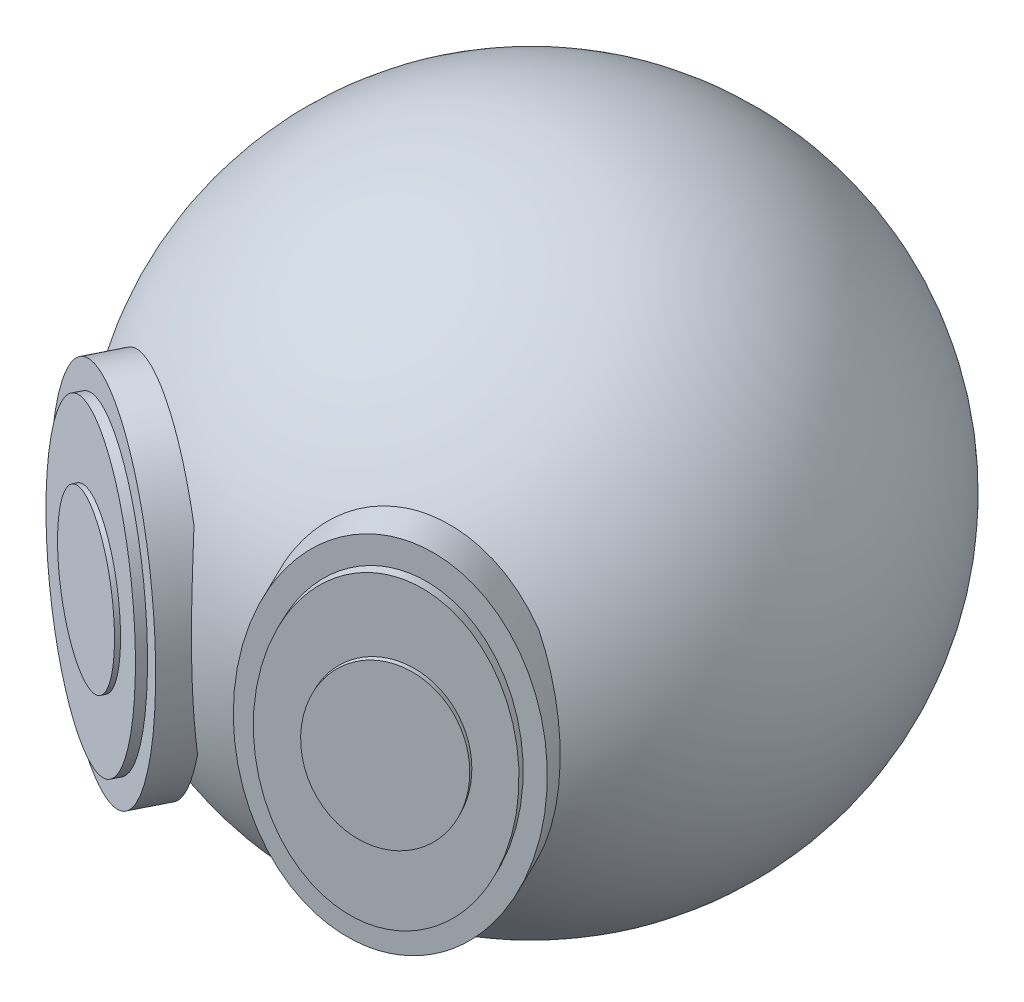
ISO-10303-21;
HEADER;
FILE_DESCRIPTION(('STEP AP214'),'2;1');
FILE_NAME('part.step','',(''),(''),'','','');
FILE_SCHEMA(('AUTOMOTIVE_DESIGN { 1 0 10303 214 1 1 1 1 }'));
ENDSEC;
DATA;
#1=APPLICATION_CONTEXT('core data for automotive mechanical design processes');
#2=APPLICATION_PROTOCOL_DEFINITION('international standard','automotive_design',2000,#1);
#3=PRODUCT_CONTEXT('',#1,'mechanical');
#4=PRODUCT('Part','Part','',(#3));
#5=PRODUCT_RELATED_PRODUCT_CATEGORY('part','',(#4));
#6=PRODUCT_DEFINITION_FORMATION('','',#4);
#7=PRODUCT_DEFINITION_CONTEXT('part definition',#1,'design');
#8=PRODUCT_DEFINITION('design','',#6,#7);
#9=PRODUCT_DEFINITION_SHAPE('','',#8);
#10=(LENGTH_UNIT() NAMED_UNIT(*) SI_UNIT(.MILLI.,.METRE.));
#11=(NAMED_UNIT(*) PLANE_ANGLE_UNIT() SI_UNIT($,.RADIAN.));
#12=(NAMED_UNIT(*) SI_UNIT($,.STERADIAN.) SOLID_ANGLE_UNIT());
#13=UNCERTAINTY_MEASURE_WITH_UNIT(LENGTH_MEASURE(1.E-05),#10,'distance_accuracy_value','');
#14=(GEOMETRIC_REPRESENTATION_CONTEXT(3) GLOBAL_UNCERTAINTY_ASSIGNED_CONTEXT((#13)) GLOBAL_UNIT_ASSIGNED_CONTEXT((#10,
#11,#12)) REPRESENTATION_CONTEXT('',''));
#15=CARTESIAN_POINT('',(0.,0.,0.));
#16=DIRECTION('',(0.,0.,1.));
#17=DIRECTION('',(1.,0.,0.));
#18=AXIS2_PLACEMENT_3D('',#15,#16,#17);
#19=CARTESIAN_POINT('',(-20.6427091276719,92.9829289428076,0.));
#20=DIRECTION('',(0.,1.,0.));
#21=DIRECTION('',(1.,0.,0.));
#22=AXIS2_PLACEMENT_3D('',#19,#20,#21);
#23=SPHERICAL_SURFACE('',#22,35.);
#24=CARTESIAN_POINT('',(-24.2981723340069,82.7245554784162,33.2626421471927));
#25=CARTESIAN_POINT('',(-24.2222567717519,83.0491589725357,33.371097447052));
#26=CARTESIAN_POINT('',(-24.151132069831,83.3765992512746,33.4743533871921));
#27=CARTESIAN_POINT('',(-24.0181068443481,84.0364422922967,33.6703114712531));
#28=CARTESIAN_POINT('',(-23.9562054797331,84.3688445990601,33.7630145772785));
#29=CARTESIAN_POINT('',(-23.8412765864362,85.037838316832,33.9376999629664));
#30=CARTESIAN_POINT('',(-23.7882458359065,85.3744281589779,34.0196861326948));
#31=CARTESIAN_POINT('',(-23.6907506248793,86.0512708374841,34.17286014985));
#32=CARTESIAN_POINT('',(-23.6462863837895,86.3915237674288,34.2440477206902));
#33=CARTESIAN_POINT('',(-23.5254121712472,87.4166133211377,34.4412041212363));
#34=CARTESIAN_POINT('',(-23.4614548644011,88.1061687773652,34.5508678538252));
#35=CARTESIAN_POINT('',(-23.3654876707696,89.4930063099794,34.7260411970147));
#36=CARTESIAN_POINT('',(-23.3334801251313,90.1902889487975,34.7915475718315));
#37=CARTESIAN_POINT('',(-23.3007703040282,91.588208229287,34.8780728142347));
#38=CARTESIAN_POINT('',(-23.3000612714456,92.2888441143501,34.8991012833389));
#39=CARTESIAN_POINT('',(-23.3298867754291,93.6894376761998,34.896570838715));
#40=CARTESIAN_POINT('',(-23.3604248498581,94.3893952672061,34.8730068758816));
#41=CARTESIAN_POINT('',(-23.4582688352174,95.8592689052093,34.7764446235933));
#42=CARTESIAN_POINT('',(-23.5291726113636,96.6286213224639,34.6984070575232));
#43=CARTESIAN_POINT('',(-23.7115722291384,98.1550587159102,34.4881530378568));
#44=CARTESIAN_POINT('',(-23.8230618671184,98.9121455484636,34.3559448639832));
#45=CARTESIAN_POINT('',(-24.0251069430692,100.046558205304,34.1148941039518));
#46=CARTESIAN_POINT('',(-24.0998372934133,100.430984157332,34.0255208570545));
#47=CARTESIAN_POINT('',(-24.2614492605759,101.19370873654,33.8326619511455));
#48=CARTESIAN_POINT('',(-24.3483302283448,101.572007689802,33.7291770459438));
#49=CARTESIAN_POINT('',(-24.534948697881,102.321703428092,33.5081979164037));
#50=CARTESIAN_POINT('',(-24.6346985359166,102.693093193859,33.3906902578836));
#51=CARTESIAN_POINT('',(-24.8478075181336,103.42738130467,33.142002315121));
#52=CARTESIAN_POINT('',(-24.9611696609854,103.790277757597,33.0108190190987));
#53=CARTESIAN_POINT('',(-25.0817252938831,104.148238487502,32.8729523810575));
#54=B_SPLINE_CURVE_WITH_KNOTS('',3,(#24,#25,#26,#27,#28,#29,#30,#31,#32,#33,#34,#35,#36,#37,#38,
#39,#40,#41,#42,#43,#44,#45,#46,#47,#48,#49,#50,#51,#52,#53),.UNSPECIFIED.,.F.,.F.,(4,2,2,2,2,2,
2,2,2,2,2,2,2,2,4),(0.,1.05157137944992,2.10304680997206,3.15413950661275,4.20525912053597,
6.30628263543237,8.40746009339388,10.508183920449,12.609145622183,14.9358374768093,
17.262173840102,18.4668491334846,19.6714601012739,20.8772345267191,22.0832750625911),.UNSPECIFIED.);
#55=CARTESIAN_POINT('',(-24.2981723340206,82.7245554783918,33.2626421471859));
#56=VERTEX_POINT('',#55);
#57=CARTESIAN_POINT('',(-25.0817252938998,104.148238487526,32.8729523810492));
#58=VERTEX_POINT('',#57);
#59=EDGE_CURVE('E237',#56,#58,#54,.T.);
#60=ORIENTED_EDGE('',*,*,#59,.F.);
#61=CARTESIAN_POINT('',(-34.6299454548464,92.9829289428076,28.1242705789723));
#62=DIRECTION('',(-0.445304960382193,0.,0.895378965722902));
#63=DIRECTION('',(0.895378965722902,0.,0.445304960382193));
#64=AXIS2_PLACEMENT_3D('',#61,#62,#63);
#65=CIRCLE('',#64,15.4396445661331);
#66=CARTESIAN_POINT('',(-44.504747512848,82.1777461212146,23.2131675627537));
#67=VERTEX_POINT('',#66);
#68=EDGE_CURVE('E230',#56,#67,#65,.F.);
#69=ORIENTED_EDGE('',*,*,#68,.T.);
#70=CARTESIAN_POINT('',(-43.6827854089606,104.651601063018,23.6219596118406));
#71=CARTESIAN_POINT('',(-43.8363377399057,104.37002522427,23.6112848937222));
#72=CARTESIAN_POINT('',(-43.983673047574,104.085043934045,23.6018104712494));
#73=CARTESIAN_POINT('',(-44.2660255710203,103.509038743438,23.5848005785608));
#74=CARTESIAN_POINT('',(-44.4010447439363,103.218015812178,23.5772647999305));
#75=CARTESIAN_POINT('',(-44.6588345130591,102.63082245896,23.563672473729));
#76=CARTESIAN_POINT('',(-44.7816140824973,102.33465599774,23.5576148376978));
#77=CARTESIAN_POINT('',(-45.0151578372269,101.737607744341,23.5465955114659));
#78=CARTESIAN_POINT('',(-45.1259213967096,101.4367257075,23.5416338783325));
#79=CARTESIAN_POINT('',(-45.4402090176429,100.528300131082,23.527892623255));
#80=CARTESIAN_POINT('',(-45.6259431624905,99.9144887863948,23.5202465390776));
#81=CARTESIAN_POINT('',(-45.9505761398571,98.6745738454274,23.5059148766946));
#82=CARTESIAN_POINT('',(-46.0894647053884,98.0484675862897,23.49922950923));
#83=CARTESIAN_POINT('',(-46.3208382694589,96.7881751994242,23.4853992316813));
#84=CARTESIAN_POINT('',(-46.4133537597444,96.153994662863,23.4782546270565));
#85=CARTESIAN_POINT('',(-46.5525044626234,94.880423777092,23.4625785441839));
#86=CARTESIAN_POINT('',(-46.5991229536354,94.2410316146168,23.4540465617932));
#87=CARTESIAN_POINT('',(-46.646649810065,92.9606579961621,23.435123609138));
#88=CARTESIAN_POINT('',(-46.6475634557949,92.3196767323294,23.424732853758));
#89=CARTESIAN_POINT('',(-46.6037990343197,91.0395241149965,23.4020327717149));
#90=CARTESIAN_POINT('',(-46.5591367343794,90.4003522122236,23.3897241098106));
#91=CARTESIAN_POINT('',(-46.4233645723454,89.1187843557572,23.3633662213213));
#92=CARTESIAN_POINT('',(-46.331671873617,88.4764505935048,23.3492968699076));
#93=CARTESIAN_POINT('',(-46.101350384298,87.2002531587313,23.3203497116773));
#94=CARTESIAN_POINT('',(-45.9627268453763,86.5663885467389,23.305471995475));
#95=CARTESIAN_POINT('',(-45.7174929228132,85.6175210735492,23.2833888106186));
#96=CARTESIAN_POINT('',(-45.6282960791918,85.2979332331253,23.2759838888655));
#97=CARTESIAN_POINT('',(-45.4374641403972,84.6624746578656,23.2615614309854));
#98=CARTESIAN_POINT('',(-45.3358294377307,84.3466038060759,23.2545438826441));
#99=CARTESIAN_POINT('',(-45.1199999155035,83.7190058517677,23.2411740478063));
#100=CARTESIAN_POINT('',(-45.005799394846,83.4072807026374,23.2348220658493));
#101=CARTESIAN_POINT('',(-44.764768619359,82.788700401116,23.2231398451208));
#102=CARTESIAN_POINT('',(-44.6379371480251,82.4818457211127,23.2178097049091));
#103=CARTESIAN_POINT('',(-44.504747512865,82.1777461212446,23.2131675627469));
#104=B_SPLINE_CURVE_WITH_KNOTS('',3,(#70,#71,#72,#73,#74,#75,#76,#77,#78,#79,#80,#81,#82,#83,
#84,#85,#86,#87,#88,#89,#90,#91,#92,#93,#94,#95,#96,#97,#98,#99,#100,#101,#102,#103),
.UNSPECIFIED.,.F.,.F.,(4,2,2,2,2,2,2,2,2,2,2,2,2,2,2,2,4),(0.,0.962581439278404,
1.92500964877472,2.88672700162827,3.84849441789137,5.770435011974,7.69279655800549,
9.61389242766158,11.5356879484321,13.4572614423312,15.3781703819498,17.3234814857843,
19.2685749767436,20.2640186114975,21.2594308407145,22.2552965641054,23.2512582936363),.UNSPECIFIED.);
#105=CARTESIAN_POINT('',(-43.682785408944,104.65160106304,23.6219596118489));
#106=VERTEX_POINT('',#105);
#107=EDGE_CURVE('E231',#106,#67,#104,.T.);
#108=ORIENTED_EDGE('',*,*,#107,.F.);
#109=EDGE_CURVE('E323',#106,#58,#65,.F.);
#110=ORIENTED_EDGE('',*,*,#109,.T.);
#111=EDGE_LOOP('',(#60,#69,#108,#110));
#112=FACE_BOUND('',#111,.T.);
#113=CARTESIAN_POINT('',(3.81536109772755,83.0057575793629,22.962117768923));
#114=CARTESIAN_POINT('',(3.94594276543495,83.3315167364795,22.9645774272464));
#115=CARTESIAN_POINT('',(4.06945745790066,83.6600822059153,22.9677289091505));
#116=CARTESIAN_POINT('',(4.30245567524122,84.3221082613997,22.9750305378118));
#117=CARTESIAN_POINT('',(4.41194051110605,84.6555683868275,22.9791805911552));
#118=CARTESIAN_POINT('',(4.61696428199144,85.3265903086422,22.9880931630469));
#119=CARTESIAN_POINT('',(4.71250889706374,85.6641503734027,22.9928554306476));
#120=CARTESIAN_POINT('',(4.88979105274628,86.3428580034786,23.0026949657917));
#121=CARTESIAN_POINT('',(4.97152823222505,86.6840056623792,23.0077722415695));
#122=CARTESIAN_POINT('',(5.19607577106631,87.7116536137169,23.0230822292017));
#123=CARTESIAN_POINT('',(5.31834262323215,88.4027552509977,23.0333989821566));
#124=CARTESIAN_POINT('',(5.50838528992758,89.7923937279887,23.0528278632463));
#125=CARTESIAN_POINT('',(5.57615504143288,90.4909313862293,23.0619398572525));
#126=CARTESIAN_POINT('',(5.65737247955005,91.8910612278794,23.0782405097496));
#127=CARTESIAN_POINT('',(5.67083042810459,92.5926528091843,23.0854295313369));
#128=CARTESIAN_POINT('',(5.64341930005406,93.9948041573588,23.0977767519847));
#129=CARTESIAN_POINT('',(5.60254980605974,94.6953639162598,23.1029349354422));
#130=CARTESIAN_POINT('',(5.4669952588152,96.0837644320592,23.1116763568978));
#131=CARTESIAN_POINT('',(5.37288487320051,96.7716613098604,23.1152756998436));
#132=CARTESIAN_POINT('',(5.13085109781815,98.1379342560205,23.1220799868563));
#133=CARTESIAN_POINT('',(4.98293661227175,98.8163118804707,23.1252849960655));
#134=CARTESIAN_POINT('',(4.71789366049756,99.8322348826407,23.131232513563));
#135=CARTESIAN_POINT('',(4.62077012936619,100.175109683099,23.1334420795384));
#136=CARTESIAN_POINT('',(4.41204111825134,100.856430899974,23.1385903434716));
#137=CARTESIAN_POINT('',(4.30043611425111,101.194877461537,23.1415290174675));
#138=CARTESIAN_POINT('',(4.06253520341563,101.866816023731,23.1485327453388));
#139=CARTESIAN_POINT('',(3.93622947598942,102.200304542543,23.1525985547142));
#140=CARTESIAN_POINT('',(3.66880809919841,102.861312754019,23.1623590860849));
#141=CARTESIAN_POINT('',(3.52769049110377,103.188831650518,23.168054023689));
#142=CARTESIAN_POINT('',(3.3790939967478,103.512930597514,23.1748147738767));
#143=B_SPLINE_CURVE_WITH_KNOTS('',3,(#113,#114,#115,#116,#117,#118,#119,#120,#121,#122,#123,
#124,#125,#126,#127,#128,#129,#130,#131,#132,#133,#134,#135,#136,#137,#138,#139,#140,#141,#142),
.UNSPECIFIED.,.F.,.F.,(4,2,2,2,2,2,2,2,2,2,2,2,2,2,4),(0.,1.05278279818046,2.10546714947467,
3.15772137123988,4.21000311030143,6.31332723491344,8.41688533053484,10.5200459507952,
12.6232227294038,14.7041200416546,16.7846731357788,17.8535227903216,18.9223373223502,
19.9918700024306,21.0615442966208),.UNSPECIFIED.);
#144=CARTESIAN_POINT('',(3.81536109772913,83.0057575793659,22.9621177689223));
#145=VERTEX_POINT('',#144);
#146=CARTESIAN_POINT('',(3.37909399674342,103.512930597525,23.1748147738761));
#147=VERTEX_POINT('',#146);
#148=EDGE_CURVE('E223',#145,#147,#143,.T.);
#149=ORIENTED_EDGE('',*,*,#148,.F.);
#150=CARTESIAN_POINT('',(-6.90066101043163,92.9829289428076,28.1865910383382));
#151=DIRECTION('',(0.438230202974221,0.,0.898862775512021));
#152=DIRECTION('',(0.898862775512021,0.,-0.438230202974221));
#153=AXIS2_PLACEMENT_3D('',#150,#151,#152);
#154=CIRCLE('',#153,15.5458096984663);
#155=CARTESIAN_POINT('',(-16.011978069711,81.196339521691,32.6287088265356));
#156=VERTEX_POINT('',#155);
#157=EDGE_CURVE('E11',#145,#156,#154,.F.);
#158=ORIENTED_EDGE('',*,*,#157,.T.);
#159=CARTESIAN_POINT('',(-15.5005641438892,105.235864475538,32.3793748518484));
#160=CARTESIAN_POINT('',(-15.6031718765869,104.960971748396,32.4996967662195));
#161=CARTESIAN_POINT('',(-15.7011061181221,104.682579193998,32.6159370370103));
#162=CARTESIAN_POINT('',(-15.888063959703,104.119557583829,32.8400568649018));
#163=CARTESIAN_POINT('',(-15.9770889207752,103.834929488755,32.9479376984619));
#164=CARTESIAN_POINT('',(-16.1466312685285,103.260333635811,33.155099469621));
#165=CARTESIAN_POINT('',(-16.2271550641115,102.970370096741,33.2543868753539));
#166=CARTESIAN_POINT('',(-16.3801432194972,102.385533730335,33.4443114039332));
#167=CARTESIAN_POINT('',(-16.4526072360005,102.090660694499,33.534948158289));
#168=CARTESIAN_POINT('',(-16.6583183155314,101.199961264181,33.7935755930772));
#169=CARTESIAN_POINT('',(-16.7800259420637,100.597568923007,33.9484582367201));
#170=CARTESIAN_POINT('',(-16.9946890441763,99.3796465698547,34.2224387391346));
#171=CARTESIAN_POINT('',(-17.0876380879947,98.7641136518875,34.3415285927973));
#172=CARTESIAN_POINT('',(-17.2462140339745,97.5239408636872,34.5433607891046));
#173=CARTESIAN_POINT('',(-17.3118534090417,96.8993052860501,34.6261197258051));
#174=CARTESIAN_POINT('',(-17.4168583201862,95.6441480491727,34.7550364884726));
#175=CARTESIAN_POINT('',(-17.4562258760924,95.0136268462112,34.8011971282397));
#176=CARTESIAN_POINT('',(-17.5092669503844,93.7499645298865,34.8567617127635));
#177=CARTESIAN_POINT('',(-17.5229432193557,93.1168237042629,34.8661695924965));
#178=CARTESIAN_POINT('',(-17.5247979557996,91.8509970633836,34.8482141927361));
#179=CARTESIAN_POINT('',(-17.512975308292,91.2183112692349,34.8208493053154));
#180=CARTESIAN_POINT('',(-17.4636426193839,89.9565381236854,34.7294582141782));
#181=CARTESIAN_POINT('',(-17.4261301080993,89.3274511241457,34.6654284855142));
#182=CARTESIAN_POINT('',(-17.3248435469091,88.0762062510829,34.5009633258345));
#183=CARTESIAN_POINT('',(-17.2610720914955,87.4540476992361,34.4005314916143));
#184=CARTESIAN_POINT('',(-17.1228879487031,86.3525781036131,34.1891279130861));
#185=CARTESIAN_POINT('',(-17.0536986044912,85.8712736903828,34.0850472699365));
#186=CARTESIAN_POINT('',(-16.8978122976389,84.9168828384826,33.8550085474954));
#187=CARTESIAN_POINT('',(-16.8111189157922,84.4437947404665,33.7290549434826));
#188=CARTESIAN_POINT('',(-16.6178697492119,83.5007136584511,33.4535881217482));
#189=CARTESIAN_POINT('',(-16.5110395078872,83.0308695961218,33.3037544041703));
#190=CARTESIAN_POINT('',(-16.3356128178734,82.3355098703499,33.0627443722292));
#191=CARTESIAN_POINT('',(-16.2745876568469,82.1052273314001,32.9796720318226));
#192=CARTESIAN_POINT('',(-16.1472774836452,81.6481170404903,32.8081814791874));
#193=CARTESIAN_POINT('',(-16.0809921519293,81.4212894994109,32.7197629422701));
#194=CARTESIAN_POINT('',(-16.0119780697095,81.196339521689,32.6287088265349));
#195=B_SPLINE_CURVE_WITH_KNOTS('',3,(#159,#160,#161,#162,#163,#164,#165,#166,#167,#168,#169,
#170,#171,#172,#173,#174,#175,#176,#177,#178,#179,#180,#181,#182,#183,#184,#185,#186,#187,#188,
#189,#190,#191,#192,#193,#194),.UNSPECIFIED.,.F.,.F.,(4,2,2,2,2,2,2,2,2,2,2,2,2,2,2,2,2,4),(0.,
0.951270888196315,1.90239623292455,2.85279933968637,3.80324291258064,5.7025290715909,
7.60223969312985,9.50108172150492,11.3997777463625,13.2982704795908,15.1968462290768,
17.0956045377451,18.9941752862599,20.4851700351003,21.9758600802334,23.4885677304756,
24.2453490363208,25.0021763497644),.UNSPECIFIED.);
#196=CARTESIAN_POINT('',(-15.5005641438909,105.235864475536,32.3793748518493));
#197=VERTEX_POINT('',#196);
#198=EDGE_CURVE('E43',#197,#156,#195,.T.);
#199=ORIENTED_EDGE('',*,*,#198,.F.);
#200=EDGE_CURVE('E54',#197,#147,#154,.F.);
#201=ORIENTED_EDGE('',*,*,#200,.T.);
#202=EDGE_LOOP('',(#149,#158,#199,#201));
#203=FACE_BOUND('',#202,.T.);
#204=ADVANCED_FACE('F38',(#112,#203),#23,.T.);
#205=CARTESIAN_POINT('',(-19.8618332990336,0.,39.9363791981702));
#206=DIRECTION('',(-0.445304960382193,0.,0.895378965722902));
#207=DIRECTION('',(0.895378965722902,0.,0.445304960382193));
#208=AXIS2_PLACEMENT_3D('',#205,#206,#207);
#209=PLANE('',#208);
#210=CARTESIAN_POINT('',(-36.2736695818161,92.3779463059205,31.7741681283546));
#211=DIRECTION('',(-0.445304960382193,0.,0.895378965722902));
#212=DIRECTION('',(0.,1.,0.));
#213=AXIS2_PLACEMENT_3D('',#210,#211,#212);
#214=ELLIPSE('',#213,17.,11.);
#215=CARTESIAN_POINT('',(-36.2736695818161,109.37794630592,31.7741681283546));
#216=VERTEX_POINT('',#215);
#217=EDGE_CURVE('E693',#216,#216,#214,.T.);
#218=ORIENTED_EDGE('',*,*,#217,.F.);
#219=EDGE_LOOP('',(#218));
#220=FACE_BOUND('',#219,.T.);
#221=CARTESIAN_POINT('',(-36.2736695818161,92.3779463059205,31.7741681283546));
#222=DIRECTION('',(-0.445304960382193,0.,0.895378965722902));
#223=DIRECTION('',(0.,1.,0.));
#224=AXIS2_PLACEMENT_3D('',#221,#222,#223);
#225=ELLIPSE('',#224,20.,13.);
#226=CARTESIAN_POINT('',(-36.2736695818161,112.37794630592,31.7741681283546));
#227=VERTEX_POINT('',#226);
#228=EDGE_CURVE('E261',#227,#227,#225,.T.);
#229=ORIENTED_EDGE('',*,*,#228,.T.);
#230=EDGE_LOOP('',(#229));
#231=FACE_BOUND('',#230,.T.);
#232=ADVANCED_FACE('F337',(#220,#231),#209,.T.);
#233=CARTESIAN_POINT('',(-18.0806134575048,0.,36.3548633352786));
#234=DIRECTION('',(-0.445304960382193,0.,0.895378965722902));
#235=DIRECTION('',(0.895378965722902,0.,0.445304960382193));
#236=AXIS2_PLACEMENT_3D('',#233,#234,#235);
#237=PLANE('',#236);
#238=ORIENTED_EDGE('',*,*,#109,.F.);
#239=CARTESIAN_POINT('',(-34.4924497402873,92.3779463059205,28.192652265463));
#240=DIRECTION('',(-0.445304960382193,0.,0.895378965722902));
#241=DIRECTION('',(0.,1.,0.));
#242=AXIS2_PLACEMENT_3D('',#239,#240,#241);
#243=ELLIPSE('',#242,20.,13.);
#244=EDGE_CURVE('E255',#58,#106,#243,.T.);
#245=ORIENTED_EDGE('',*,*,#244,.F.);
#246=EDGE_LOOP('',(#238,#245));
#247=FACE_BOUND('',#246,.T.);
#248=ADVANCED_FACE('F249',(#247),#237,.F.);
#249=DIRECTION('',(-0.445304960382193,0.,0.895378965722902));
#250=VECTOR('',#249,1.);
#251=SURFACE_OF_LINEAR_EXTRUSION('',#243,#250);
#252=ORIENTED_EDGE('',*,*,#244,.T.);
#253=ORIENTED_EDGE('',*,*,#107,.T.);
#254=EDGE_CURVE('E260',#67,#56,#243,.T.);
#255=ORIENTED_EDGE('',*,*,#254,.T.);
#256=ORIENTED_EDGE('',*,*,#59,.T.);
#257=EDGE_LOOP('',(#252,#253,#255,#256));
#258=FACE_BOUND('',#257,.T.);
#259=ORIENTED_EDGE('',*,*,#228,.F.);
#260=EDGE_LOOP('',(#259));
#261=FACE_BOUND('',#260,.T.);
#262=ADVANCED_FACE('F242',(#258,#261),#251,.T.);
#263=ORIENTED_EDGE('',*,*,#68,.F.);
#264=ORIENTED_EDGE('',*,*,#254,.F.);
#265=EDGE_LOOP('',(#263,#264));
#266=FACE_BOUND('',#265,.T.);
#267=ADVANCED_FACE('F248',(#266),#237,.F.);
#268=CARTESIAN_POINT('',(11.5306251818999,0.,23.6506970173415));
#269=DIRECTION('',(0.438230202974221,0.,0.898862775512021));
#270=DIRECTION('',(0.898862775512021,0.,-0.438230202974221));
#271=AXIS2_PLACEMENT_3D('',#268,#269,#270);
#272=PLANE('',#271);
#273=CARTESIAN_POINT('',(-4.67353229283477,92.6346600832413,31.5508475326793));
#274=DIRECTION('',(0.438230202974221,0.,0.898862775512021));
#275=DIRECTION('',(0.,1.,0.));
#276=AXIS2_PLACEMENT_3D('',#273,#274,#275);
#277=ELLIPSE('',#276,17.,11.);
#278=CARTESIAN_POINT('',(-4.67353229283477,109.634660083241,31.5508475326793));
#279=VERTEX_POINT('',#278);
#280=EDGE_CURVE('E687',#279,#279,#277,.T.);
#281=ORIENTED_EDGE('',*,*,#280,.F.);
#282=EDGE_LOOP('',(#281));
#283=FACE_BOUND('',#282,.T.);
#284=CARTESIAN_POINT('',(-4.67353229283478,92.6346600832413,31.5508475326793));
#285=DIRECTION('',(0.438230202974221,0.,0.898862775512021));
#286=DIRECTION('',(0.,1.,0.));
#287=AXIS2_PLACEMENT_3D('',#284,#285,#286);
#288=ELLIPSE('',#287,20.,13.);
#289=CARTESIAN_POINT('',(-4.67353229283478,112.634660083241,31.5508475326793));
#290=VERTEX_POINT('',#289);
#291=EDGE_CURVE('E202',#290,#290,#288,.T.);
#292=ORIENTED_EDGE('',*,*,#291,.T.);
#293=EDGE_LOOP('',(#292));
#294=FACE_BOUND('',#293,.T.);
#295=ADVANCED_FACE('F343',(#283,#294),#272,.T.);
#296=CARTESIAN_POINT('',(9.77770437000305,0.,20.0552459152934));
#297=DIRECTION('',(0.438230202974221,0.,0.898862775512021));
#298=DIRECTION('',(0.898862775512021,0.,-0.438230202974221));
#299=AXIS2_PLACEMENT_3D('',#296,#297,#298);
#300=PLANE('',#299);
#301=ORIENTED_EDGE('',*,*,#200,.F.);
#302=CARTESIAN_POINT('',(-6.42645310473167,92.6346600832413,27.9553964306312));
#303=DIRECTION('',(0.438230202974221,0.,0.898862775512021));
#304=DIRECTION('',(0.,1.,0.));
#305=AXIS2_PLACEMENT_3D('',#302,#303,#304);
#306=ELLIPSE('',#305,20.,13.);
#307=EDGE_CURVE('E205',#147,#197,#306,.T.);
#308=ORIENTED_EDGE('',*,*,#307,.F.);
#309=EDGE_LOOP('',(#301,#308));
#310=FACE_BOUND('',#309,.T.);
#311=ADVANCED_FACE('F217',(#310),#300,.F.);
#312=DIRECTION('',(0.438230202974221,0.,0.89886277551202));
#313=VECTOR('',#312,1.);
#314=SURFACE_OF_LINEAR_EXTRUSION('',#306,#313);
#315=ORIENTED_EDGE('',*,*,#307,.T.);
#316=ORIENTED_EDGE('',*,*,#198,.T.);
#317=EDGE_CURVE('E191',#156,#145,#306,.T.);
#318=ORIENTED_EDGE('',*,*,#317,.T.);
#319=ORIENTED_EDGE('',*,*,#148,.T.);
#320=EDGE_LOOP('',(#315,#316,#318,#319));
#321=FACE_BOUND('',#320,.T.);
#322=ORIENTED_EDGE('',*,*,#291,.F.);
#323=EDGE_LOOP('',(#322));
#324=FACE_BOUND('',#323,.T.);
#325=ADVANCED_FACE('F211',(#321,#324),#314,.T.);
#326=ORIENTED_EDGE('',*,*,#157,.F.);
#327=ORIENTED_EDGE('',*,*,#317,.F.);
#328=EDGE_LOOP('',(#326,#327));
#329=FACE_BOUND('',#328,.T.);
#330=ADVANCED_FACE('F216',(#329),#300,.F.);
#331=CARTESIAN_POINT('',(-36.7189745421983,92.3779463059205,32.6695470940775));
#332=DIRECTION('',(-0.445304960382193,0.,0.895378965722902));
#333=DIRECTION('',(0.,1.,0.));
#334=AXIS2_PLACEMENT_3D('',#331,#332,#333);
#335=ELLIPSE('',#334,17.,11.);
#336=DIRECTION('',(0.445304960382193,0.,-0.895378965722902));
#337=VECTOR('',#336,1.);
#338=SURFACE_OF_LINEAR_EXTRUSION('',#335,#337);
#339=CARTESIAN_POINT('',(-36.7189745421983,109.37794630592,32.6695470940775));
#340=VERTEX_POINT('',#339);
#341=EDGE_CURVE('E181',#340,#340,#335,.T.);
#342=ORIENTED_EDGE('',*,*,#341,.F.);
#343=EDGE_LOOP('',(#342));
#344=FACE_BOUND('',#343,.T.);
#345=ORIENTED_EDGE('',*,*,#217,.T.);
#346=EDGE_LOOP('',(#345));
#347=FACE_BOUND('',#346,.T.);
#348=ADVANCED_FACE('F478',(#344,#347),#338,.F.);
#349=CARTESIAN_POINT('',(-36.7189745421983,92.3779463059205,32.6695470940775));
#350=DIRECTION('',(-0.445304960382193,0.,0.895378965722902));
#351=DIRECTION('',(0.895378965722902,0.,0.445304960382193));
#352=AXIS2_PLACEMENT_3D('',#349,#350,#351);
#353=PLANE('',#352);
#354=CARTESIAN_POINT('',(-36.413120380813,92.3779463059205,32.8216596413144));
#355=DIRECTION('',(-0.445304960382193,0.,0.895378965722902));
#356=DIRECTION('',(0.,1.,0.));
#357=AXIS2_PLACEMENT_3D('',#354,#355,#356);
#358=ELLIPSE('',#357,8.99999999999999,7.);
#359=CARTESIAN_POINT('',(-36.413120380813,101.37794630592,32.8216596413144));
#360=VERTEX_POINT('',#359);
#361=EDGE_CURVE('E680',#360,#360,#358,.T.);
#362=ORIENTED_EDGE('',*,*,#361,.F.);
#363=EDGE_LOOP('',(#362));
#364=FACE_BOUND('',#363,.T.);
#365=ORIENTED_EDGE('',*,*,#341,.T.);
#366=EDGE_LOOP('',(#365));
#367=FACE_BOUND('',#366,.T.);
#368=ADVANCED_FACE('F534',(#364,#367),#353,.T.);
#369=CARTESIAN_POINT('',(-4.23530208986055,92.6346600832413,32.4497103081913));
#370=DIRECTION('',(0.438230202974221,0.,0.898862775512021));
#371=DIRECTION('',(0.,1.,0.));
#372=AXIS2_PLACEMENT_3D('',#369,#370,#371);
#373=ELLIPSE('',#372,17.,11.);
#374=DIRECTION('',(-0.438230202974221,0.,-0.898862775512021));
#375=VECTOR('',#374,1.);
#376=SURFACE_OF_LINEAR_EXTRUSION('',#373,#375);
#377=CARTESIAN_POINT('',(-4.23530208986055,109.634660083241,32.4497103081913));
#378=VERTEX_POINT('',#377);
#379=EDGE_CURVE('E689',#378,#378,#373,.T.);
#380=ORIENTED_EDGE('',*,*,#379,.F.);
#381=EDGE_LOOP('',(#380));
#382=FACE_BOUND('',#381,.T.);
#383=ORIENTED_EDGE('',*,*,#280,.T.);
#384=EDGE_LOOP('',(#383));
#385=FACE_BOUND('',#384,.T.);
#386=ADVANCED_FACE('F582',(#382,#385),#376,.F.);
#387=CARTESIAN_POINT('',(-4.23530208986055,92.6346600832413,32.4497103081913));
#388=DIRECTION('',(0.438230202974221,0.,0.898862775512021));
#389=DIRECTION('',(0.898862775512021,0.,-0.438230202974221));
#390=AXIS2_PLACEMENT_3D('',#387,#388,#389);
#391=PLANE('',#390);
#392=CARTESIAN_POINT('',(-4.15218633028064,92.6346600832413,32.4091881760224));
#393=DIRECTION('',(0.438230202974221,0.,0.898862775512021));
#394=DIRECTION('',(0.,1.,0.));
#395=AXIS2_PLACEMENT_3D('',#392,#393,#394);
#396=ELLIPSE('',#395,8.99999999999999,7.);
#397=CARTESIAN_POINT('',(-4.15218633028064,101.634660083241,32.4091881760224));
#398=VERTEX_POINT('',#397);
#399=EDGE_CURVE('E679',#398,#398,#396,.T.);
#400=ORIENTED_EDGE('',*,*,#399,.F.);
#401=EDGE_LOOP('',(#400));
#402=FACE_BOUND('',#401,.T.);
#403=ORIENTED_EDGE('',*,*,#379,.T.);
#404=EDGE_LOOP('',(#403));
#405=FACE_BOUND('',#404,.T.);
#406=ADVANCED_FACE('F586',(#402,#405),#391,.T.);
#407=CARTESIAN_POINT('',(-3.93307122879353,92.6346600832413,32.8586195637784));
#408=DIRECTION('',(0.438230202974221,0.,0.898862775512021));
#409=DIRECTION('',(0.,1.,0.));
#410=AXIS2_PLACEMENT_3D('',#407,#408,#409);
#411=ELLIPSE('',#410,8.99999999999999,7.);
#412=DIRECTION('',(-0.438230202974221,0.,-0.898862775512021));
#413=VECTOR('',#412,1.);
#414=SURFACE_OF_LINEAR_EXTRUSION('',#411,#413);
#415=CARTESIAN_POINT('',(-3.93307122879353,101.634660083241,32.8586195637784));
#416=VERTEX_POINT('',#415);
#417=EDGE_CURVE('E683',#416,#416,#411,.T.);
#418=ORIENTED_EDGE('',*,*,#417,.F.);
#419=EDGE_LOOP('',(#418));
#420=FACE_BOUND('',#419,.T.);
#421=ORIENTED_EDGE('',*,*,#399,.T.);
#422=EDGE_LOOP('',(#421));
#423=FACE_BOUND('',#422,.T.);
#424=ADVANCED_FACE('F625',(#420,#423),#414,.F.);
#425=CARTESIAN_POINT('',(-3.93307122879353,92.6346600832413,32.8586195637784));
#426=DIRECTION('',(0.438230202974221,0.,0.898862775512021));
#427=DIRECTION('',(0.898862775512021,0.,-0.438230202974221));
#428=AXIS2_PLACEMENT_3D('',#425,#426,#427);
#429=PLANE('',#428);
#430=ORIENTED_EDGE('',*,*,#417,.T.);
#431=EDGE_LOOP('',(#430));
#432=FACE_BOUND('',#431,.T.);
#433=ADVANCED_FACE('F634',(#432),#429,.T.);
#434=CARTESIAN_POINT('',(-36.6357728610041,92.3779463059205,33.2693491241758));
#435=DIRECTION('',(-0.445304960382193,0.,0.895378965722902));
#436=DIRECTION('',(0.,1.,0.));
#437=AXIS2_PLACEMENT_3D('',#434,#435,#436);
#438=ELLIPSE('',#437,8.99999999999999,7.);
#439=DIRECTION('',(0.445304960382193,0.,-0.895378965722902));
#440=VECTOR('',#439,1.);
#441=SURFACE_OF_LINEAR_EXTRUSION('',#438,#440);
#442=CARTESIAN_POINT('',(-36.6357728610041,101.37794630592,33.2693491241758));
#443=VERTEX_POINT('',#442);
#444=EDGE_CURVE('E676',#443,#443,#438,.T.);
#445=ORIENTED_EDGE('',*,*,#444,.F.);
#446=EDGE_LOOP('',(#445));
#447=FACE_BOUND('',#446,.T.);
#448=ORIENTED_EDGE('',*,*,#361,.T.);
#449=EDGE_LOOP('',(#448));
#450=FACE_BOUND('',#449,.T.);
#451=ADVANCED_FACE('F644',(#447,#450),#441,.F.);
#452=CARTESIAN_POINT('',(-36.6357728610041,92.3779463059205,33.2693491241758));
#453=DIRECTION('',(-0.445304960382193,0.,0.895378965722902));
#454=DIRECTION('',(0.895378965722902,0.,0.445304960382193));
#455=AXIS2_PLACEMENT_3D('',#452,#453,#454);
#456=PLANE('',#455);
#457=ORIENTED_EDGE('',*,*,#444,.T.);
#458=EDGE_LOOP('',(#457));
#459=FACE_BOUND('',#458,.T.);
#460=ADVANCED_FACE('F661',(#459),#456,.T.);
#461=CLOSED_SHELL('',(#204,#232,#248,#262,#267,#295,#311,#325,#330,#348,#368,#386,#406,#424,
#433,#451,#460));
#462=CARTESIAN_POINT('',(11.0923949789257,102.,22.7518342418295));
#463=DIRECTION('',(-0.438230202974221,0.,-0.898862775512021));
#464=DIRECTION('',(-0.898862775512021,0.,0.438230202974221));
#465=AXIS2_PLACEMENT_3D('',#462,#463,#464);
#466=PLANE('',#465);
#467=CARTESIAN_POINT('',(-5.58597040150897,92.9829289428076,30.8831793648742));
#468=DIRECTION('',(-0.438230202974221,0.,-0.898862775512021));
#469=DIRECTION('',(-0.898862775512021,0.,0.438230202974221));
#470=AXIS2_PLACEMENT_3D('',#467,#468,#469);
#471=CIRCLE('',#470,6.67261951927994);
#472=CARTESIAN_POINT('',(-5.11176249580901,99.6346600832413,30.6519847571672));
#473=VERTEX_POINT('',#472);
#474=CARTESIAN_POINT('',(-5.60270592195632,99.6555224864544,30.8913385752924));
#475=VERTEX_POINT('',#474);
#476=EDGE_CURVE('E187',#473,#475,#471,.F.);
#477=ORIENTED_EDGE('',*,*,#476,.F.);
#478=DIRECTION('',(0.,-1.,0.));
#479=VECTOR('',#478,1.);
#480=CARTESIAN_POINT('',(-5.11176249580901,102.,30.6519847571673));
#481=LINE('',#480,#479);
#482=CARTESIAN_POINT('',(-5.11176249580901,102.,30.6519847571673));
#483=VERTEX_POINT('',#482);
#484=EDGE_CURVE('E306',#483,#473,#481,.T.);
#485=ORIENTED_EDGE('',*,*,#484,.F.);
#486=DIRECTION('',(0.898862775512021,0.,-0.438230202974221));
#487=VECTOR('',#486,1.);
#488=CARTESIAN_POINT('',(11.0923949789257,102.,22.7518342418295));
#489=LINE('',#488,#487);
#490=CARTESIAN_POINT('',(-5.60270592195632,102.,30.8913385752924));
#491=VERTEX_POINT('',#490);
#492=EDGE_CURVE('E304',#491,#483,#489,.T.);
#493=ORIENTED_EDGE('',*,*,#492,.F.);
#494=DIRECTION('',(0.,-1.,0.));
#495=VECTOR('',#494,1.);
#496=CARTESIAN_POINT('',(-5.60270592195632,102.,30.8913385752924));
#497=LINE('',#496,#495);
#498=EDGE_CURVE('E308',#491,#475,#497,.T.);
#499=ORIENTED_EDGE('',*,*,#498,.T.);
#500=EDGE_LOOP('',(#477,#485,#493,#499));
#501=FACE_BOUND('',#500,.T.);
#502=ADVANCED_FACE('F387',(#501),#466,.F.);
#503=CARTESIAN_POINT('',(-6.90066101043163,92.9829289428076,28.1865910383381));
#504=DIRECTION('',(0.438230202974221,0.,0.89886277551202));
#505=DIRECTION('',(0.898862775512021,0.,-0.438230202974221));
#506=AXIS2_PLACEMENT_3D('',#503,#504,#505);
#507=CYLINDRICAL_SURFACE('',#506,6.67261951927994);
#508=DIRECTION('',(0.438230202974221,0.,0.89886277551202));
#509=VECTOR('',#508,1.);
#510=CARTESIAN_POINT('',(-6.42645310473167,99.6346600832413,27.9553964306312));
#511=LINE('',#510,#509);
#512=CARTESIAN_POINT('',(-4.67353229283479,99.6346600832413,31.5508475326793));
#513=VERTEX_POINT('',#512);
#514=EDGE_CURVE('E209',#473,#513,#511,.T.);
#515=ORIENTED_EDGE('',*,*,#514,.F.);
#516=ORIENTED_EDGE('',*,*,#476,.T.);
#517=DIRECTION('',(0.438230202974221,0.,0.89886277551202));
#518=VECTOR('',#517,1.);
#519=CARTESIAN_POINT('',(-6.91739653087899,99.6555224864544,28.1947502487564));
#520=LINE('',#519,#518);
#521=CARTESIAN_POINT('',(-5.1644757189821,99.6555224864544,31.7902013508045));
#522=VERTEX_POINT('',#521);
#523=EDGE_CURVE('E184',#475,#522,#520,.T.);
#524=ORIENTED_EDGE('',*,*,#523,.T.);
#525=CARTESIAN_POINT('',(-5.14774019853475,92.9829289428076,31.7820421403862));
#526=DIRECTION('',(0.438230202974221,0.,0.898862775512021));
#527=DIRECTION('',(0.898862775512021,0.,-0.438230202974221));
#528=AXIS2_PLACEMENT_3D('',#525,#526,#527);
#529=CIRCLE('',#528,6.67261951927994);
#530=EDGE_CURVE('E170',#522,#513,#529,.F.);
#531=ORIENTED_EDGE('',*,*,#530,.T.);
#532=EDGE_LOOP('',(#515,#516,#524,#531));
#533=FACE_BOUND('',#532,.T.);
#534=ADVANCED_FACE('F185',(#533),#507,.T.);
#535=CARTESIAN_POINT('',(9.77770437000305,102.,20.0552459152934));
#536=DIRECTION('',(0.,1.,0.));
#537=DIRECTION('',(0.,0.,1.));
#538=AXIS2_PLACEMENT_3D('',#535,#536,#537);
#539=PLANE('',#538);
#540=DIRECTION('',(0.438230202974221,0.,0.89886277551202));
#541=VECTOR('',#540,1.);
#542=CARTESIAN_POINT('',(-6.91739653087899,102.,28.1947502487564));
#543=LINE('',#542,#541);
#544=CARTESIAN_POINT('',(-5.1644757189821,102.,31.7902013508045));
#545=VERTEX_POINT('',#544);
#546=EDGE_CURVE('E190',#491,#545,#543,.T.);
#547=ORIENTED_EDGE('',*,*,#546,.F.);
#548=ORIENTED_EDGE('',*,*,#492,.T.);
#549=DIRECTION('',(0.438230202974221,0.,0.89886277551202));
#550=VECTOR('',#549,1.);
#551=CARTESIAN_POINT('',(-6.42645310473167,102.,27.9553964306312));
#552=LINE('',#551,#550);
#553=CARTESIAN_POINT('',(-4.67353229283478,102.,31.5508475326793));
#554=VERTEX_POINT('',#553);
#555=EDGE_CURVE('E722',#483,#554,#552,.T.);
#556=ORIENTED_EDGE('',*,*,#555,.T.);
#557=DIRECTION('',(-0.898862775512021,0.,0.438230202974221));
#558=VECTOR('',#557,1.);
#559=CARTESIAN_POINT('',(11.5306251818999,102.,23.6506970173415));
#560=LINE('',#559,#558);
#561=EDGE_CURVE('E196',#554,#545,#560,.T.);
#562=ORIENTED_EDGE('',*,*,#561,.T.);
#563=EDGE_LOOP('',(#547,#548,#556,#562));
#564=FACE_BOUND('',#563,.T.);
#565=ADVANCED_FACE('F375',(#564),#539,.F.);
#566=CARTESIAN_POINT('',(-6.42645310473167,0.,27.9553964306312));
#567=DIRECTION('',(0.89886277551202,0.,-0.438230202974221));
#568=DIRECTION('',(-0.438230202974221,0.,-0.898862775512021));
#569=AXIS2_PLACEMENT_3D('',#566,#567,#568);
#570=PLANE('',#569);
#571=ORIENTED_EDGE('',*,*,#555,.F.);
#572=ORIENTED_EDGE('',*,*,#484,.T.);
#573=ORIENTED_EDGE('',*,*,#514,.T.);
#574=DIRECTION('',(0.,1.,0.));
#575=VECTOR('',#574,1.);
#576=CARTESIAN_POINT('',(-4.67353229283478,0.,31.5508475326793));
#577=LINE('',#576,#575);
#578=EDGE_CURVE('E177',#513,#554,#577,.T.);
#579=ORIENTED_EDGE('',*,*,#578,.T.);
#580=EDGE_LOOP('',(#571,#572,#573,#579));
#581=FACE_BOUND('',#580,.T.);
#582=ADVANCED_FACE('F369',(#581),#570,.F.);
#583=CARTESIAN_POINT('',(-6.91739653087898,0.,28.1947502487564));
#584=DIRECTION('',(-0.89886277551202,0.,0.438230202974221));
#585=DIRECTION('',(0.438230202974221,0.,0.898862775512021));
#586=AXIS2_PLACEMENT_3D('',#583,#584,#585);
#587=PLANE('',#586);
#588=ORIENTED_EDGE('',*,*,#523,.F.);
#589=ORIENTED_EDGE('',*,*,#498,.F.);
#590=ORIENTED_EDGE('',*,*,#546,.T.);
#591=DIRECTION('',(0.,-1.,0.));
#592=VECTOR('',#591,1.);
#593=CARTESIAN_POINT('',(-5.1644757189821,0.,31.7902013508045));
#594=LINE('',#593,#592);
#595=EDGE_CURVE('E174',#545,#522,#594,.T.);
#596=ORIENTED_EDGE('',*,*,#595,.T.);
#597=EDGE_LOOP('',(#588,#589,#590,#596));
#598=FACE_BOUND('',#597,.T.);
#599=ADVANCED_FACE('F193',(#598),#587,.F.);
#600=CARTESIAN_POINT('',(-4.67353229283477,92.6346600832413,31.5508475326793));
#601=DIRECTION('',(0.438230202974221,0.,0.898862775512021));
#602=DIRECTION('',(0.898862775512021,0.,-0.438230202974221));
#603=AXIS2_PLACEMENT_3D('',#600,#601,#602);
#604=PLANE('',#603);
#605=ORIENTED_EDGE('',*,*,#595,.F.);
#606=ORIENTED_EDGE('',*,*,#561,.F.);
#607=ORIENTED_EDGE('',*,*,#578,.F.);
#608=ORIENTED_EDGE('',*,*,#530,.F.);
#609=EDGE_LOOP('',(#605,#606,#607,#608));
#610=FACE_BOUND('',#609,.T.);
#611=ADVANCED_FACE('F172',(#610),#604,.F.);
#612=CLOSED_SHELL('',(#502,#534,#565,#582,#599,#611));
#613=CARTESIAN_POINT('',(-19.4165283386514,102.,39.0410002324473));
#614=DIRECTION('',(-0.445304960382193,0.,0.895378965722902));
#615=DIRECTION('',(0.895378965722902,0.,0.445304960382193));
#616=AXIS2_PLACEMENT_3D('',#613,#614,#615);
#617=PLANE('',#616);
#618=DIRECTION('',(0.,-1.,0.));
#619=VECTOR('',#618,1.);
#620=CARTESIAN_POINT('',(-36.3557382124957,102.,30.616506838538));
#621=LINE('',#620,#619);
#622=CARTESIAN_POINT('',(-36.3557382124957,102.,30.616506838538));
#623=VERTEX_POINT('',#622);
#624=CARTESIAN_POINT('',(-36.3557382124957,99.3649526019016,30.616506838538));
#625=VERTEX_POINT('',#624);
#626=EDGE_CURVE('E294',#623,#625,#621,.T.);
#627=ORIENTED_EDGE('',*,*,#626,.T.);
#628=CARTESIAN_POINT('',(-35.9658603359929,92.9829289428076,30.810407476141));
#629=DIRECTION('',(-0.445304960382193,0.,0.895378965722902));
#630=DIRECTION('',(0.895378965722902,0.,0.445304960382193));
#631=AXIS2_PLACEMENT_3D('',#628,#629,#630);
#632=CIRCLE('',#631,6.39686080832501);
#633=CARTESIAN_POINT('',(-35.8283646214339,99.3779463059205,30.8787891626317));
#634=VERTEX_POINT('',#633);
#635=EDGE_CURVE('E318',#625,#634,#632,.F.);
#636=ORIENTED_EDGE('',*,*,#635,.T.);
#637=DIRECTION('',(0.,-1.,0.));
#638=VECTOR('',#637,1.);
#639=CARTESIAN_POINT('',(-35.8283646214339,102.,30.8787891626317));
#640=LINE('',#639,#638);
#641=CARTESIAN_POINT('',(-35.8283646214339,102.,30.8787891626317));
#642=VERTEX_POINT('',#641);
#643=EDGE_CURVE('E292',#642,#634,#640,.T.);
#644=ORIENTED_EDGE('',*,*,#643,.F.);
#645=DIRECTION('',(-0.895378965722902,0.,-0.445304960382193));
#646=VECTOR('',#645,1.);
#647=CARTESIAN_POINT('',(-19.4165283386514,102.,39.0410002324473));
#648=LINE('',#647,#646);
#649=EDGE_CURVE('E289',#642,#623,#648,.T.);
#650=ORIENTED_EDGE('',*,*,#649,.T.);
#651=EDGE_LOOP('',(#627,#636,#644,#650));
#652=FACE_BOUND('',#651,.T.);
#653=ADVANCED_FACE('F400',(#652),#617,.T.);
#654=CARTESIAN_POINT('',(-35.0198233313491,0.,27.9303699413693));
#655=DIRECTION('',(-0.895378965722902,0.,-0.445304960382193));
#656=DIRECTION('',(-0.445304960382193,0.,0.895378965722902));
#657=AXIS2_PLACEMENT_3D('',#654,#655,#656);
#658=PLANE('',#657);
#659=ORIENTED_EDGE('',*,*,#626,.F.);
#660=DIRECTION('',(-0.445304960382193,0.,0.895378965722902));
#661=VECTOR('',#660,1.);
#662=CARTESIAN_POINT('',(-35.0198233313491,102.,27.9303699413693));
#663=LINE('',#662,#661);
#664=CARTESIAN_POINT('',(-36.8010431728779,102.,31.5118858042609));
#665=VERTEX_POINT('',#664);
#666=EDGE_CURVE('E275',#623,#665,#663,.T.);
#667=ORIENTED_EDGE('',*,*,#666,.T.);
#668=DIRECTION('',(0.,-1.,0.));
#669=VECTOR('',#668,1.);
#670=CARTESIAN_POINT('',(-36.8010431728779,0.,31.5118858042609));
#671=LINE('',#670,#669);
#672=CARTESIAN_POINT('',(-36.8010431728779,99.3649526019016,31.5118858042609));
#673=VERTEX_POINT('',#672);
#674=EDGE_CURVE('E714',#665,#673,#671,.T.);
#675=ORIENTED_EDGE('',*,*,#674,.T.);
#676=DIRECTION('',(-0.445304960382193,0.,0.895378965722902));
#677=VECTOR('',#676,1.);
#678=CARTESIAN_POINT('',(-35.0198233313491,99.3649526019016,27.9303699413693));
#679=LINE('',#678,#677);
#680=EDGE_CURVE('E263',#625,#673,#679,.T.);
#681=ORIENTED_EDGE('',*,*,#680,.F.);
#682=EDGE_LOOP('',(#659,#667,#675,#681));
#683=FACE_BOUND('',#682,.T.);
#684=ADVANCED_FACE('F403',(#683),#658,.F.);
#685=CARTESIAN_POINT('',(-34.6299454548464,92.9829289428076,28.1242705789723));
#686=DIRECTION('',(-0.445304960382193,0.,0.895378965722902));
#687=DIRECTION('',(0.895378965722902,0.,0.445304960382193));
#688=AXIS2_PLACEMENT_3D('',#685,#686,#687);
#689=CYLINDRICAL_SURFACE('',#688,6.39686080832501);
#690=ORIENTED_EDGE('',*,*,#635,.F.);
#691=ORIENTED_EDGE('',*,*,#680,.T.);
#692=CARTESIAN_POINT('',(-36.4111652963751,92.9829289428076,31.7057864418639));
#693=DIRECTION('',(-0.445304960382193,0.,0.895378965722902));
#694=DIRECTION('',(0.895378965722902,0.,0.445304960382193));
#695=AXIS2_PLACEMENT_3D('',#692,#693,#694);
#696=CIRCLE('',#695,6.39686080832501);
#697=CARTESIAN_POINT('',(-36.2736695818161,99.3779463059205,31.7741681283546));
#698=VERTEX_POINT('',#697);
#699=EDGE_CURVE('E704',#673,#698,#696,.F.);
#700=ORIENTED_EDGE('',*,*,#699,.T.);
#701=DIRECTION('',(-0.445304960382193,0.,0.895378965722902));
#702=VECTOR('',#701,1.);
#703=CARTESIAN_POINT('',(-34.4924497402873,99.3779463059205,28.192652265463));
#704=LINE('',#703,#702);
#705=EDGE_CURVE('E267',#634,#698,#704,.T.);
#706=ORIENTED_EDGE('',*,*,#705,.F.);
#707=EDGE_LOOP('',(#690,#691,#700,#706));
#708=FACE_BOUND('',#707,.T.);
#709=ADVANCED_FACE('F252',(#708),#689,.T.);
#710=CARTESIAN_POINT('',(-34.4924497402873,0.,28.192652265463));
#711=DIRECTION('',(0.895378965722902,0.,0.445304960382193));
#712=DIRECTION('',(0.445304960382193,0.,-0.895378965722902));
#713=AXIS2_PLACEMENT_3D('',#710,#711,#712);
#714=PLANE('',#713);
#715=ORIENTED_EDGE('',*,*,#643,.T.);
#716=ORIENTED_EDGE('',*,*,#705,.T.);
#717=DIRECTION('',(0.,1.,0.));
#718=VECTOR('',#717,1.);
#719=CARTESIAN_POINT('',(-36.2736695818161,0.,31.7741681283546));
#720=LINE('',#719,#718);
#721=CARTESIAN_POINT('',(-36.2736695818161,102.,31.7741681283546));
#722=VERTEX_POINT('',#721);
#723=EDGE_CURVE('E706',#698,#722,#720,.T.);
#724=ORIENTED_EDGE('',*,*,#723,.T.);
#725=DIRECTION('',(-0.445304960382193,0.,0.895378965722902));
#726=VECTOR('',#725,1.);
#727=CARTESIAN_POINT('',(-34.4924497402873,102.,28.192652265463));
#728=LINE('',#727,#726);
#729=EDGE_CURVE('E271',#642,#722,#728,.T.);
#730=ORIENTED_EDGE('',*,*,#729,.F.);
#731=EDGE_LOOP('',(#715,#716,#724,#730));
#732=FACE_BOUND('',#731,.T.);
#733=ADVANCED_FACE('F413',(#732),#714,.F.);
#734=CARTESIAN_POINT('',(-18.0806134575048,102.,36.3548633352786));
#735=DIRECTION('',(0.,1.,0.));
#736=DIRECTION('',(0.,0.,1.));
#737=AXIS2_PLACEMENT_3D('',#734,#735,#736);
#738=PLANE('',#737);
#739=ORIENTED_EDGE('',*,*,#649,.F.);
#740=ORIENTED_EDGE('',*,*,#729,.T.);
#741=DIRECTION('',(-0.895378965722902,0.,-0.445304960382193));
#742=VECTOR('',#741,1.);
#743=CARTESIAN_POINT('',(-19.8618332990336,102.,39.9363791981702));
#744=LINE('',#743,#742);
#745=EDGE_CURVE('E709',#722,#665,#744,.T.);
#746=ORIENTED_EDGE('',*,*,#745,.T.);
#747=ORIENTED_EDGE('',*,*,#666,.F.);
#748=EDGE_LOOP('',(#739,#740,#746,#747));
#749=FACE_BOUND('',#748,.T.);
#750=ADVANCED_FACE('F410',(#749),#738,.F.);
#751=CARTESIAN_POINT('',(-36.2736695818161,92.3779463059205,31.7741681283546));
#752=DIRECTION('',(-0.445304960382193,0.,0.895378965722902));
#753=DIRECTION('',(0.895378965722902,0.,0.445304960382193));
#754=AXIS2_PLACEMENT_3D('',#751,#752,#753);
#755=PLANE('',#754);
#756=ORIENTED_EDGE('',*,*,#674,.F.);
#757=ORIENTED_EDGE('',*,*,#745,.F.);
#758=ORIENTED_EDGE('',*,*,#723,.F.);
#759=ORIENTED_EDGE('',*,*,#699,.F.);
#760=EDGE_LOOP('',(#756,#757,#758,#759));
#761=FACE_BOUND('',#760,.T.);
#762=ADVANCED_FACE('F412',(#761),#755,.F.);
#763=CLOSED_SHELL('',(#653,#684,#709,#733,#750,#762));
#764=CARTESIAN_POINT('',(-19.225850499611,102.,38.6576024680035));
#765=DIRECTION('',(0.445304960382193,0.,-0.895378965722902));
#766=DIRECTION('',(-0.895378965722902,0.,-0.445304960382193));
#767=AXIS2_PLACEMENT_3D('',#764,#765,#766);
#768=PLANE('',#767);
#769=DIRECTION('',(0.,-1.,0.));
#770=VECTOR('',#769,1.);
#771=CARTESIAN_POINT('',(-35.6376867823935,102.,30.4953913981879));
#772=LINE('',#771,#770);
#773=CARTESIAN_POINT('',(-35.6376867823935,102.,30.4953913981879));
#774=VERTEX_POINT('',#773);
#775=CARTESIAN_POINT('',(-35.6376867823935,101.36038372369,30.4953913981879));
#776=VERTEX_POINT('',#775);
#777=EDGE_CURVE('E299',#774,#776,#772,.T.);
#778=ORIENTED_EDGE('',*,*,#777,.T.);
#779=CARTESIAN_POINT('',(-35.7751824969526,92.9829289428076,30.4270097116972));
#780=DIRECTION('',(0.445304960382193,0.,-0.895378965722902));
#781=DIRECTION('',(-0.895378965722902,0.,-0.445304960382193));
#782=AXIS2_PLACEMENT_3D('',#779,#780,#781);
#783=CIRCLE('',#782,8.3788620786056);
#784=CARTESIAN_POINT('',(-36.1650603734553,101.350469054241,30.2331090740942));
#785=VERTEX_POINT('',#784);
#786=EDGE_CURVE('E321',#776,#785,#783,.F.);
#787=ORIENTED_EDGE('',*,*,#786,.T.);
#788=DIRECTION('',(0.,-1.,0.));
#789=VECTOR('',#788,1.);
#790=CARTESIAN_POINT('',(-36.1650603734553,102.,30.2331090740942));
#791=LINE('',#790,#789);
#792=CARTESIAN_POINT('',(-36.1650603734553,102.,30.2331090740942));
#793=VERTEX_POINT('',#792);
#794=EDGE_CURVE('E297',#793,#785,#791,.T.);
#795=ORIENTED_EDGE('',*,*,#794,.F.);
#796=DIRECTION('',(0.895378965722902,0.,0.445304960382193));
#797=VECTOR('',#796,1.);
#798=CARTESIAN_POINT('',(-19.225850499611,102.,38.6576024680035));
#799=LINE('',#798,#797);
#800=EDGE_CURVE('E286',#793,#774,#799,.T.);
#801=ORIENTED_EDGE('',*,*,#800,.T.);
#802=EDGE_LOOP('',(#778,#787,#795,#801));
#803=FACE_BOUND('',#802,.T.);
#804=ADVANCED_FACE('F350',(#803),#768,.T.);
#805=CARTESIAN_POINT('',(-20.6427091276719,102.,0.));
#806=DIRECTION('',(0.,1.,0.));
#807=DIRECTION('',(0.,0.,1.));
#808=AXIS2_PLACEMENT_3D('',#805,#806,#807);
#809=CIRCLE('',#808,33.8185219894298);
#810=CARTESIAN_POINT('',(-35.564613754907,102.,30.3484627591785));
#811=VERTEX_POINT('',#810);
#812=CARTESIAN_POINT('',(-36.0908942547329,102.,30.083982546026));
#813=VERTEX_POINT('',#812);
#814=EDGE_CURVE('E283',#811,#813,#809,.F.);
#815=ORIENTED_EDGE('',*,*,#814,.T.);
#816=CARTESIAN_POINT('',(-21.0325870041746,92.9829289428076,-0.193900637602971));
#817=DIRECTION('',(-0.895378965722902,0.,-0.445304960382193));
#818=DIRECTION('',(-0.445304960382193,0.,0.895378965722902));
#819=AXIS2_PLACEMENT_3D('',#816,#817,#818);
#820=CIRCLE('',#819,34.9972912921008);
#821=EDGE_CURVE('E280',#813,#785,#820,.F.);
#822=ORIENTED_EDGE('',*,*,#821,.T.);
#823=ORIENTED_EDGE('',*,*,#786,.F.);
#824=CARTESIAN_POINT('',(-20.5052134131128,92.9829289428076,0.0683816864907099));
#825=DIRECTION('',(0.895378965722902,0.,0.445304960382193));
#826=DIRECTION('',(0.445304960382193,0.,-0.895378965722902));
#827=AXIS2_PLACEMENT_3D('',#824,#825,#826);
#828=CIRCLE('',#827,34.9996631251421);
#829=EDGE_CURVE('E266',#776,#811,#828,.F.);
#830=ORIENTED_EDGE('',*,*,#829,.T.);
#831=EDGE_LOOP('',(#815,#822,#823,#830));
#832=FACE_BOUND('',#831,.T.);
#833=ADVANCED_FACE('F40',(#832),#23,.T.);
#834=ORIENTED_EDGE('',*,*,#814,.F.);
#835=EDGE_CURVE('E270',#811,#774,#728,.T.);
#836=ORIENTED_EDGE('',*,*,#835,.T.);
#837=ORIENTED_EDGE('',*,*,#800,.F.);
#838=EDGE_CURVE('E274',#813,#793,#663,.T.);
#839=ORIENTED_EDGE('',*,*,#838,.F.);
#840=EDGE_LOOP('',(#834,#836,#837,#839));
#841=FACE_BOUND('',#840,.T.);
#842=ADVANCED_FACE('F349',(#841),#738,.F.);
#843=ORIENTED_EDGE('',*,*,#821,.F.);
#844=ORIENTED_EDGE('',*,*,#838,.T.);
#845=ORIENTED_EDGE('',*,*,#794,.T.);
#846=EDGE_LOOP('',(#843,#844,#845));
#847=FACE_BOUND('',#846,.T.);
#848=ADVANCED_FACE('F409',(#847),#658,.F.);
#849=ORIENTED_EDGE('',*,*,#829,.F.);
#850=ORIENTED_EDGE('',*,*,#777,.F.);
#851=ORIENTED_EDGE('',*,*,#835,.F.);
#852=EDGE_LOOP('',(#849,#850,#851));
#853=FACE_BOUND('',#852,.T.);
#854=ADVANCED_FACE('F417',(#853),#714,.F.);
#855=CLOSED_SHELL('',(#804,#833,#842,#848,#854));
#856=CARTESIAN_POINT('',(-20.1685012219719,92.9829289428076,-0.231194607706944));
#857=DIRECTION('',(0.89886277551202,0.,-0.438230202974221));
#858=DIRECTION('',(-0.438230202974221,0.,-0.898862775512021));
#859=AXIS2_PLACEMENT_3D('',#856,#857,#858);
#860=CIRCLE('',#859,34.9960237157815);
#861=CARTESIAN_POINT('',(-5.24575354657095,101.055247891414,30.3771530204128));
#862=VERTEX_POINT('',#861);
#863=CARTESIAN_POINT('',(-5.3500068780297,102.,30.1633169172976));
#864=VERTEX_POINT('',#863);
#865=EDGE_CURVE('E61',#862,#864,#860,.F.);
#866=ORIENTED_EDGE('',*,*,#865,.F.);
#867=DIRECTION('',(0.,-1.,0.));
#868=VECTOR('',#867,1.);
#869=CARTESIAN_POINT('',(-5.24575354657095,102.,30.3771530204128));
#870=LINE('',#869,#868);
#871=CARTESIAN_POINT('',(-5.24575354657095,102.,30.3771530204128));
#872=VERTEX_POINT('',#871);
#873=EDGE_CURVE('E313',#872,#862,#870,.T.);
#874=ORIENTED_EDGE('',*,*,#873,.F.);
#875=EDGE_CURVE('E724',#864,#872,#552,.T.);
#876=ORIENTED_EDGE('',*,*,#875,.F.);
#877=EDGE_LOOP('',(#866,#874,#876));
#878=FACE_BOUND('',#877,.T.);
#879=ADVANCED_FACE('F220',(#878),#570,.F.);
#880=CARTESIAN_POINT('',(-20.6427091276719,102.,0.));
#881=DIRECTION('',(0.,1.,0.));
#882=DIRECTION('',(0.,0.,1.));
#883=AXIS2_PLACEMENT_3D('',#880,#881,#882);
#884=CIRCLE('',#883,33.8185219894298);
#885=CARTESIAN_POINT('',(-5.8391491384013,102.,30.4063651427396));
#886=VERTEX_POINT('',#885);
#887=EDGE_CURVE('E65',#864,#886,#884,.F.);
#888=ORIENTED_EDGE('',*,*,#887,.F.);
#889=ORIENTED_EDGE('',*,*,#875,.T.);
#890=DIRECTION('',(0.89886277551202,0.,-0.438230202974222));
#891=VECTOR('',#890,1.);
#892=CARTESIAN_POINT('',(10.9584039281638,102.,22.477002505075));
#893=LINE('',#892,#891);
#894=CARTESIAN_POINT('',(-5.73669697271827,102.,30.616506838538));
#895=VERTEX_POINT('',#894);
#896=EDGE_CURVE('E302',#895,#872,#893,.T.);
#897=ORIENTED_EDGE('',*,*,#896,.F.);
#898=EDGE_CURVE('E721',#886,#895,#543,.T.);
#899=ORIENTED_EDGE('',*,*,#898,.F.);
#900=EDGE_LOOP('',(#888,#889,#897,#899));
#901=FACE_BOUND('',#900,.T.);
#902=ADVANCED_FACE('F367',(#901),#539,.F.);
#903=CARTESIAN_POINT('',(-20.6594446481192,92.9829289428076,0.00815921041823615));
#904=DIRECTION('',(-0.89886277551202,0.,0.438230202974221));
#905=DIRECTION('',(0.438230202974221,0.,0.898862775512021));
#906=AXIS2_PLACEMENT_3D('',#903,#904,#905);
#907=CIRCLE('',#906,34.9999950478517);
#908=CARTESIAN_POINT('',(-5.73669697271828,101.072447509579,30.616506838538));
#909=VERTEX_POINT('',#908);
#910=EDGE_CURVE('E719',#886,#909,#907,.F.);
#911=ORIENTED_EDGE('',*,*,#910,.F.);
#912=ORIENTED_EDGE('',*,*,#898,.T.);
#913=DIRECTION('',(0.,-1.,0.));
#914=VECTOR('',#913,1.);
#915=CARTESIAN_POINT('',(-5.73669697271827,102.,30.616506838538));
#916=LINE('',#915,#914);
#917=EDGE_CURVE('E310',#895,#909,#916,.T.);
#918=ORIENTED_EDGE('',*,*,#917,.T.);
#919=EDGE_LOOP('',(#911,#912,#918));
#920=FACE_BOUND('',#919,.T.);
#921=ADVANCED_FACE('F361',(#920),#587,.F.);
#922=CARTESIAN_POINT('',(10.9584039281638,102.,22.477002505075));
#923=DIRECTION('',(-0.438230202974222,0.,-0.89886277551202));
#924=DIRECTION('',(-0.89886277551202,0.,0.438230202974222));
#925=AXIS2_PLACEMENT_3D('',#922,#923,#924);
#926=PLANE('',#925);
#927=ORIENTED_EDGE('',*,*,#873,.T.);
#928=CARTESIAN_POINT('',(-5.71996145227087,92.9829289428076,30.6083476281197));
#929=DIRECTION('',(-0.438230202974222,0.,-0.89886277551202));
#930=DIRECTION('',(-0.89886277551202,0.,0.438230202974222));
#931=AXIS2_PLACEMENT_3D('',#928,#929,#930);
#932=CIRCLE('',#931,8.08953999263811);
#933=EDGE_CURVE('E316',#862,#909,#932,.F.);
#934=ORIENTED_EDGE('',*,*,#933,.T.);
#935=ORIENTED_EDGE('',*,*,#917,.F.);
#936=ORIENTED_EDGE('',*,*,#896,.T.);
#937=EDGE_LOOP('',(#927,#934,#935,#936));
#938=FACE_BOUND('',#937,.T.);
#939=ADVANCED_FACE('F355',(#938),#926,.T.);
#940=ORIENTED_EDGE('',*,*,#933,.F.);
#941=ORIENTED_EDGE('',*,*,#865,.T.);
#942=ORIENTED_EDGE('',*,*,#887,.T.);
#943=ORIENTED_EDGE('',*,*,#910,.T.);
#944=EDGE_LOOP('',(#940,#941,#942,#943));
#945=FACE_BOUND('',#944,.T.);
#946=ADVANCED_FACE('F345',(#945),#23,.T.);
#947=CLOSED_SHELL('',(#879,#902,#921,#939,#946));
#948=ORIENTED_CLOSED_SHELL('',*,#612,.T.);
#949=ORIENTED_CLOSED_SHELL('',*,#763,.T.);
#950=ORIENTED_CLOSED_SHELL('',*,#855,.T.);
#951=ORIENTED_CLOSED_SHELL('',*,#947,.T.);
#952=BREP_WITH_VOIDS('B2',#461,(#948,#949,#950,#951));
#953=ADVANCED_BREP_SHAPE_REPRESENTATION('',(#18,#952),#14);
#954=SHAPE_DEFINITION_REPRESENTATION(#9,#953);
ENDSEC;
END-ISO-10303-21;
